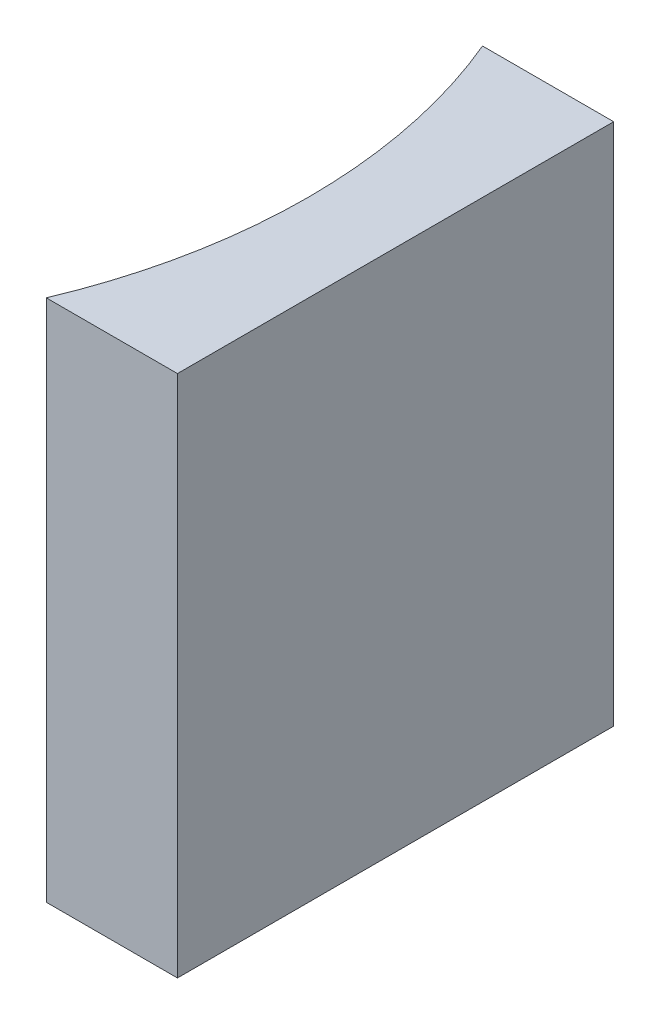
ISO-10303-21;
HEADER;
FILE_DESCRIPTION(('STEP AP214'),'2;1');
FILE_NAME('part.step','',(''),(''),'','','');
FILE_SCHEMA(('AUTOMOTIVE_DESIGN { 1 0 10303 214 1 1 1 1 }'));
ENDSEC;
DATA;
#1=APPLICATION_CONTEXT('core data for automotive mechanical design processes');
#2=APPLICATION_PROTOCOL_DEFINITION('international standard','automotive_design',2000,#1);
#3=PRODUCT_CONTEXT('',#1,'mechanical');
#4=PRODUCT('Part','Part','',(#3));
#5=PRODUCT_RELATED_PRODUCT_CATEGORY('part','',(#4));
#6=PRODUCT_DEFINITION_FORMATION('','',#4);
#7=PRODUCT_DEFINITION_CONTEXT('part definition',#1,'design');
#8=PRODUCT_DEFINITION('design','',#6,#7);
#9=PRODUCT_DEFINITION_SHAPE('','',#8);
#10=(LENGTH_UNIT() NAMED_UNIT(*) SI_UNIT(.MILLI.,.METRE.));
#11=(NAMED_UNIT(*) PLANE_ANGLE_UNIT() SI_UNIT($,.RADIAN.));
#12=(NAMED_UNIT(*) SI_UNIT($,.STERADIAN.) SOLID_ANGLE_UNIT());
#13=UNCERTAINTY_MEASURE_WITH_UNIT(LENGTH_MEASURE(1.E-05),#10,'distance_accuracy_value','');
#14=(GEOMETRIC_REPRESENTATION_CONTEXT(3) GLOBAL_UNCERTAINTY_ASSIGNED_CONTEXT((#13)) GLOBAL_UNIT_ASSIGNED_CONTEXT((#10,
#11,#12)) REPRESENTATION_CONTEXT('',''));
#15=CARTESIAN_POINT('',(0.,0.,0.));
#16=DIRECTION('',(0.,0.,1.));
#17=DIRECTION('',(1.,0.,0.));
#18=AXIS2_PLACEMENT_3D('',#15,#16,#17);
#19=CARTESIAN_POINT('',(0.,12.,0.));
#20=DIRECTION('',(0.,0.,1.));
#21=DIRECTION('',(1.,0.,0.));
#22=AXIS2_PLACEMENT_3D('',#19,#20,#21);
#23=PLANE('',#22);
#24=DIRECTION('',(-1.,0.,0.));
#25=VECTOR('',#24,1.);
#26=CARTESIAN_POINT('',(0.,0.,0.));
#27=LINE('',#26,#25);
#28=CARTESIAN_POINT('',(0.,0.,0.));
#29=VERTEX_POINT('',#28);
#30=CARTESIAN_POINT('',(-3.00586900440959,0.,0.));
#31=VERTEX_POINT('',#30);
#32=EDGE_CURVE('E100',#29,#31,#27,.T.);
#33=ORIENTED_EDGE('',*,*,#32,.T.);
#34=DIRECTION('',(0.,-1.,0.));
#35=VECTOR('',#34,1.);
#36=CARTESIAN_POINT('',(-3.00586900440959,12.,0.));
#37=LINE('',#36,#35);
#38=CARTESIAN_POINT('',(-3.00586900440959,12.,0.));
#39=VERTEX_POINT('',#38);
#40=EDGE_CURVE('E11',#39,#31,#37,.T.);
#41=ORIENTED_EDGE('',*,*,#40,.F.);
#42=DIRECTION('',(-1.,0.,0.));
#43=VECTOR('',#42,1.);
#44=CARTESIAN_POINT('',(0.,12.,0.));
#45=LINE('',#44,#43);
#46=CARTESIAN_POINT('',(0.,12.,0.));
#47=VERTEX_POINT('',#46);
#48=EDGE_CURVE('E88',#47,#39,#45,.T.);
#49=ORIENTED_EDGE('',*,*,#48,.F.);
#50=DIRECTION('',(0.,-1.,0.));
#51=VECTOR('',#50,1.);
#52=CARTESIAN_POINT('',(0.,12.,0.));
#53=LINE('',#52,#51);
#54=EDGE_CURVE('E96',#47,#29,#53,.T.);
#55=ORIENTED_EDGE('',*,*,#54,.T.);
#56=EDGE_LOOP('',(#33,#41,#49,#55));
#57=FACE_BOUND('',#56,.T.);
#58=ADVANCED_FACE('F37',(#57),#23,.F.);
#59=CARTESIAN_POINT('',(-14.93,12.,5.));
#60=DIRECTION('',(0.,-1.,0.));
#61=DIRECTION('',(0.,0.,-1.));
#62=AXIS2_PLACEMENT_3D('',#59,#60,#61);
#63=CYLINDRICAL_SURFACE('',#62,12.93);
#64=CARTESIAN_POINT('',(-14.93,0.,5.));
#65=DIRECTION('',(0.,-1.,0.));
#66=DIRECTION('',(0.,0.,1.));
#67=AXIS2_PLACEMENT_3D('',#64,#65,#66);
#68=CIRCLE('',#67,12.93);
#69=CARTESIAN_POINT('',(-3.00586900440959,0.,10.));
#70=VERTEX_POINT('',#69);
#71=EDGE_CURVE('E92',#31,#70,#68,.T.);
#72=ORIENTED_EDGE('',*,*,#71,.T.);
#73=DIRECTION('',(0.,-1.,0.));
#74=VECTOR('',#73,1.);
#75=CARTESIAN_POINT('',(-3.00586900440959,12.,10.));
#76=LINE('',#75,#74);
#77=CARTESIAN_POINT('',(-3.00586900440959,12.,10.));
#78=VERTEX_POINT('',#77);
#79=EDGE_CURVE('E45',#78,#70,#76,.T.);
#80=ORIENTED_EDGE('',*,*,#79,.F.);
#81=CARTESIAN_POINT('',(-14.93,12.,5.));
#82=DIRECTION('',(0.,-1.,0.));
#83=DIRECTION('',(0.,0.,1.));
#84=AXIS2_PLACEMENT_3D('',#81,#82,#83);
#85=CIRCLE('',#84,12.93);
#86=EDGE_CURVE('E83',#39,#78,#85,.T.);
#87=ORIENTED_EDGE('',*,*,#86,.F.);
#88=ORIENTED_EDGE('',*,*,#40,.T.);
#89=EDGE_LOOP('',(#72,#80,#87,#88));
#90=FACE_BOUND('',#89,.T.);
#91=ADVANCED_FACE('F91',(#90),#63,.F.);
#92=CARTESIAN_POINT('',(0.,12.,10.));
#93=DIRECTION('',(0.,0.,-1.));
#94=DIRECTION('',(-1.,0.,0.));
#95=AXIS2_PLACEMENT_3D('',#92,#93,#94);
#96=PLANE('',#95);
#97=DIRECTION('',(1.,0.,0.));
#98=VECTOR('',#97,1.);
#99=CARTESIAN_POINT('',(0.,0.,10.));
#100=LINE('',#99,#98);
#101=CARTESIAN_POINT('',(0.,0.,10.));
#102=VERTEX_POINT('',#101);
#103=EDGE_CURVE('E70',#70,#102,#100,.T.);
#104=ORIENTED_EDGE('',*,*,#103,.T.);
#105=DIRECTION('',(0.,-1.,0.));
#106=VECTOR('',#105,1.);
#107=CARTESIAN_POINT('',(0.,12.,10.));
#108=LINE('',#107,#106);
#109=CARTESIAN_POINT('',(0.,12.,10.));
#110=VERTEX_POINT('',#109);
#111=EDGE_CURVE('E93',#110,#102,#108,.T.);
#112=ORIENTED_EDGE('',*,*,#111,.F.);
#113=DIRECTION('',(1.,0.,0.));
#114=VECTOR('',#113,1.);
#115=CARTESIAN_POINT('',(0.,12.,10.));
#116=LINE('',#115,#114);
#117=EDGE_CURVE('E86',#78,#110,#116,.T.);
#118=ORIENTED_EDGE('',*,*,#117,.F.);
#119=ORIENTED_EDGE('',*,*,#79,.T.);
#120=EDGE_LOOP('',(#104,#112,#118,#119));
#121=FACE_BOUND('',#120,.T.);
#122=ADVANCED_FACE('F94',(#121),#96,.F.);
#123=CARTESIAN_POINT('',(0.,12.,0.));
#124=DIRECTION('',(-1.,0.,0.));
#125=DIRECTION('',(0.,0.,1.));
#126=AXIS2_PLACEMENT_3D('',#123,#124,#125);
#127=PLANE('',#126);
#128=DIRECTION('',(0.,0.,-1.));
#129=VECTOR('',#128,1.);
#130=CARTESIAN_POINT('',(0.,0.,0.));
#131=LINE('',#130,#129);
#132=EDGE_CURVE('E76',#102,#29,#131,.T.);
#133=ORIENTED_EDGE('',*,*,#132,.T.);
#134=ORIENTED_EDGE('',*,*,#54,.F.);
#135=DIRECTION('',(0.,0.,-1.));
#136=VECTOR('',#135,1.);
#137=CARTESIAN_POINT('',(0.,12.,0.));
#138=LINE('',#137,#136);
#139=EDGE_CURVE('E53',#110,#47,#138,.T.);
#140=ORIENTED_EDGE('',*,*,#139,.F.);
#141=ORIENTED_EDGE('',*,*,#111,.T.);
#142=EDGE_LOOP('',(#133,#134,#140,#141));
#143=FACE_BOUND('',#142,.T.);
#144=ADVANCED_FACE('F107',(#143),#127,.F.);
#145=CARTESIAN_POINT('',(-14.93,12.,5.));
#146=DIRECTION('',(0.,1.,0.));
#147=DIRECTION('',(0.,0.,1.));
#148=AXIS2_PLACEMENT_3D('',#145,#146,#147);
#149=PLANE('',#148);
#150=ORIENTED_EDGE('',*,*,#48,.T.);
#151=ORIENTED_EDGE('',*,*,#86,.T.);
#152=ORIENTED_EDGE('',*,*,#117,.T.);
#153=ORIENTED_EDGE('',*,*,#139,.T.);
#154=EDGE_LOOP('',(#150,#151,#152,#153));
#155=FACE_BOUND('',#154,.T.);
#156=ADVANCED_FACE('F84',(#155),#149,.T.);
#157=CARTESIAN_POINT('',(-14.93,0.,5.));
#158=DIRECTION('',(0.,1.,0.));
#159=DIRECTION('',(0.,0.,1.));
#160=AXIS2_PLACEMENT_3D('',#157,#158,#159);
#161=PLANE('',#160);
#162=ORIENTED_EDGE('',*,*,#32,.F.);
#163=ORIENTED_EDGE('',*,*,#132,.F.);
#164=ORIENTED_EDGE('',*,*,#103,.F.);
#165=ORIENTED_EDGE('',*,*,#71,.F.);
#166=EDGE_LOOP('',(#162,#163,#164,#165));
#167=FACE_BOUND('',#166,.T.);
#168=ADVANCED_FACE('F110',(#167),#161,.F.);
#169=CLOSED_SHELL('',(#58,#91,#122,#144,#156,#168));
#170=MANIFOLD_SOLID_BREP('B2',#169);
#171=ADVANCED_BREP_SHAPE_REPRESENTATION('',(#18,#170),#14);
#172=SHAPE_DEFINITION_REPRESENTATION(#9,#171);
ENDSEC;
END-ISO-10303-21;
